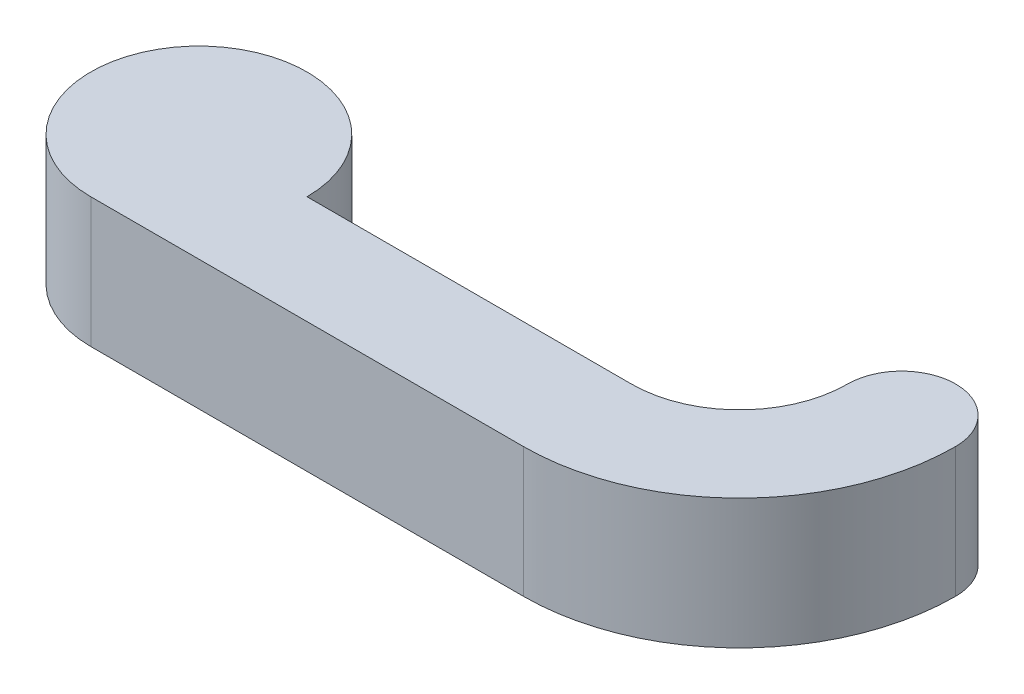
ISO-10303-21;
HEADER;
FILE_DESCRIPTION(('STEP AP214'),'2;1');
FILE_NAME('part.step','',(''),(''),'','','');
FILE_SCHEMA(('AUTOMOTIVE_DESIGN { 1 0 10303 214 1 1 1 1 }'));
ENDSEC;
DATA;
#1=APPLICATION_CONTEXT('core data for automotive mechanical design processes');
#2=APPLICATION_PROTOCOL_DEFINITION('international standard','automotive_design',2000,#1);
#3=PRODUCT_CONTEXT('',#1,'mechanical');
#4=PRODUCT('Part','Part','',(#3));
#5=PRODUCT_RELATED_PRODUCT_CATEGORY('part','',(#4));
#6=PRODUCT_DEFINITION_FORMATION('','',#4);
#7=PRODUCT_DEFINITION_CONTEXT('part definition',#1,'design');
#8=PRODUCT_DEFINITION('design','',#6,#7);
#9=PRODUCT_DEFINITION_SHAPE('','',#8);
#10=(LENGTH_UNIT() NAMED_UNIT(*) SI_UNIT(.MILLI.,.METRE.));
#11=(NAMED_UNIT(*) PLANE_ANGLE_UNIT() SI_UNIT($,.RADIAN.));
#12=(NAMED_UNIT(*) SI_UNIT($,.STERADIAN.) SOLID_ANGLE_UNIT());
#13=UNCERTAINTY_MEASURE_WITH_UNIT(LENGTH_MEASURE(1.E-05),#10,'distance_accuracy_value','');
#14=(GEOMETRIC_REPRESENTATION_CONTEXT(3) GLOBAL_UNCERTAINTY_ASSIGNED_CONTEXT((#13)) GLOBAL_UNIT_ASSIGNED_CONTEXT((#10,
#11,#12)) REPRESENTATION_CONTEXT('',''));
#15=CARTESIAN_POINT('',(0.,0.,0.));
#16=DIRECTION('',(0.,0.,1.));
#17=DIRECTION('',(1.,0.,0.));
#18=AXIS2_PLACEMENT_3D('',#15,#16,#17);
#19=CARTESIAN_POINT('',(0.,3.,0.));
#20=DIRECTION('',(0.,-1.,0.));
#21=DIRECTION('',(0.,0.,-1.));
#22=AXIS2_PLACEMENT_3D('',#19,#20,#21);
#23=CYLINDRICAL_SURFACE('',#22,5.);
#24=CARTESIAN_POINT('',(0.,-3.,0.));
#25=DIRECTION('',(0.,1.,0.));
#26=DIRECTION('',(0.,0.,1.));
#27=AXIS2_PLACEMENT_3D('',#24,#25,#26);
#28=CIRCLE('',#27,5.);
#29=CARTESIAN_POINT('',(5.,-3.,0.));
#30=VERTEX_POINT('',#29);
#31=CARTESIAN_POINT('',(0.,-3.,5.));
#32=VERTEX_POINT('',#31);
#33=EDGE_CURVE('E119',#30,#32,#28,.T.);
#34=ORIENTED_EDGE('',*,*,#33,.T.);
#35=DIRECTION('',(0.,-1.,0.));
#36=VECTOR('',#35,1.);
#37=CARTESIAN_POINT('',(0.,3.,5.));
#38=LINE('',#37,#36);
#39=CARTESIAN_POINT('',(0.,3.,5.));
#40=VERTEX_POINT('',#39);
#41=EDGE_CURVE('E11',#40,#32,#38,.T.);
#42=ORIENTED_EDGE('',*,*,#41,.F.);
#43=CARTESIAN_POINT('',(0.,3.,0.));
#44=DIRECTION('',(0.,1.,0.));
#45=DIRECTION('',(0.,0.,1.));
#46=AXIS2_PLACEMENT_3D('',#43,#44,#45);
#47=CIRCLE('',#46,5.);
#48=CARTESIAN_POINT('',(5.,3.,0.));
#49=VERTEX_POINT('',#48);
#50=EDGE_CURVE('E133',#49,#40,#47,.T.);
#51=ORIENTED_EDGE('',*,*,#50,.F.);
#52=DIRECTION('',(0.,-1.,0.));
#53=VECTOR('',#52,1.);
#54=CARTESIAN_POINT('',(5.,3.,0.));
#55=LINE('',#54,#53);
#56=EDGE_CURVE('E51',#49,#30,#55,.T.);
#57=ORIENTED_EDGE('',*,*,#56,.T.);
#58=EDGE_LOOP('',(#34,#42,#51,#57));
#59=FACE_BOUND('',#58,.T.);
#60=ADVANCED_FACE('F35',(#59),#23,.T.);
#61=CARTESIAN_POINT('',(0.,3.,5.));
#62=DIRECTION('',(0.,0.,-1.));
#63=DIRECTION('',(-1.,0.,0.));
#64=AXIS2_PLACEMENT_3D('',#61,#62,#63);
#65=PLANE('',#64);
#66=DIRECTION('',(1.,0.,0.));
#67=VECTOR('',#66,1.);
#68=CARTESIAN_POINT('',(0.,-3.,5.));
#69=LINE('',#68,#67);
#70=CARTESIAN_POINT('',(20.,-3.,5.));
#71=VERTEX_POINT('',#70);
#72=EDGE_CURVE('E121',#32,#71,#69,.T.);
#73=ORIENTED_EDGE('',*,*,#72,.T.);
#74=DIRECTION('',(0.,-1.,0.));
#75=VECTOR('',#74,1.);
#76=CARTESIAN_POINT('',(20.,3.,5.));
#77=LINE('',#76,#75);
#78=CARTESIAN_POINT('',(20.,3.,5.));
#79=VERTEX_POINT('',#78);
#80=EDGE_CURVE('E43',#79,#71,#77,.T.);
#81=ORIENTED_EDGE('',*,*,#80,.F.);
#82=DIRECTION('',(1.,0.,0.));
#83=VECTOR('',#82,1.);
#84=CARTESIAN_POINT('',(0.,3.,5.));
#85=LINE('',#84,#83);
#86=EDGE_CURVE('E83',#40,#79,#85,.T.);
#87=ORIENTED_EDGE('',*,*,#86,.F.);
#88=ORIENTED_EDGE('',*,*,#41,.T.);
#89=EDGE_LOOP('',(#73,#81,#87,#88));
#90=FACE_BOUND('',#89,.T.);
#91=ADVANCED_FACE('F153',(#90),#65,.F.);
#92=CARTESIAN_POINT('',(20.,3.,-5.));
#93=DIRECTION('',(0.,-1.,0.));
#94=DIRECTION('',(0.,0.,-1.));
#95=AXIS2_PLACEMENT_3D('',#92,#93,#94);
#96=CYLINDRICAL_SURFACE('',#95,10.);
#97=CARTESIAN_POINT('',(20.,-3.,-5.));
#98=DIRECTION('',(0.,1.,0.));
#99=DIRECTION('',(0.,0.,1.));
#100=AXIS2_PLACEMENT_3D('',#97,#98,#99);
#101=CIRCLE('',#100,10.);
#102=CARTESIAN_POINT('',(30.,-3.,-5.));
#103=VERTEX_POINT('',#102);
#104=EDGE_CURVE('E124',#71,#103,#101,.T.);
#105=ORIENTED_EDGE('',*,*,#104,.T.);
#106=DIRECTION('',(0.,-1.,0.));
#107=VECTOR('',#106,1.);
#108=CARTESIAN_POINT('',(30.,3.,-5.));
#109=LINE('',#108,#107);
#110=CARTESIAN_POINT('',(30.,3.,-5.));
#111=VERTEX_POINT('',#110);
#112=EDGE_CURVE('E102',#111,#103,#109,.T.);
#113=ORIENTED_EDGE('',*,*,#112,.F.);
#114=CARTESIAN_POINT('',(20.,3.,-5.));
#115=DIRECTION('',(0.,1.,0.));
#116=DIRECTION('',(0.,0.,1.));
#117=AXIS2_PLACEMENT_3D('',#114,#115,#116);
#118=CIRCLE('',#117,10.);
#119=EDGE_CURVE('E110',#79,#111,#118,.T.);
#120=ORIENTED_EDGE('',*,*,#119,.F.);
#121=ORIENTED_EDGE('',*,*,#80,.T.);
#122=EDGE_LOOP('',(#105,#113,#120,#121));
#123=FACE_BOUND('',#122,.T.);
#124=ADVANCED_FACE('F139',(#123),#96,.T.);
#125=CARTESIAN_POINT('',(27.5,3.,-5.));
#126=DIRECTION('',(0.,-1.,0.));
#127=DIRECTION('',(0.,0.,-1.));
#128=AXIS2_PLACEMENT_3D('',#125,#126,#127);
#129=CYLINDRICAL_SURFACE('',#128,2.5);
#130=CARTESIAN_POINT('',(27.5,-3.,-5.));
#131=DIRECTION('',(0.,1.,0.));
#132=DIRECTION('',(0.,0.,1.));
#133=AXIS2_PLACEMENT_3D('',#130,#131,#132);
#134=CIRCLE('',#133,2.5);
#135=CARTESIAN_POINT('',(25.,-3.,-5.));
#136=VERTEX_POINT('',#135);
#137=EDGE_CURVE('E98',#136,#103,#134,.F.);
#138=ORIENTED_EDGE('',*,*,#137,.F.);
#139=DIRECTION('',(0.,-1.,0.));
#140=VECTOR('',#139,1.);
#141=CARTESIAN_POINT('',(25.,3.,-5.));
#142=LINE('',#141,#140);
#143=CARTESIAN_POINT('',(25.,3.,-5.));
#144=VERTEX_POINT('',#143);
#145=EDGE_CURVE('E93',#144,#136,#142,.T.);
#146=ORIENTED_EDGE('',*,*,#145,.F.);
#147=CARTESIAN_POINT('',(27.5,3.,-5.));
#148=DIRECTION('',(0.,1.,0.));
#149=DIRECTION('',(0.,0.,1.));
#150=AXIS2_PLACEMENT_3D('',#147,#148,#149);
#151=CIRCLE('',#150,2.5);
#152=EDGE_CURVE('E96',#144,#111,#151,.F.);
#153=ORIENTED_EDGE('',*,*,#152,.T.);
#154=ORIENTED_EDGE('',*,*,#112,.T.);
#155=EDGE_LOOP('',(#138,#146,#153,#154));
#156=FACE_BOUND('',#155,.T.);
#157=ADVANCED_FACE('F95',(#156),#129,.T.);
#158=CARTESIAN_POINT('',(20.,3.,-5.));
#159=DIRECTION('',(0.,-1.,0.));
#160=DIRECTION('',(0.,0.,-1.));
#161=AXIS2_PLACEMENT_3D('',#158,#159,#160);
#162=CYLINDRICAL_SURFACE('',#161,5.);
#163=CARTESIAN_POINT('',(20.,-3.,-5.));
#164=DIRECTION('',(0.,1.,0.));
#165=DIRECTION('',(0.,0.,1.));
#166=AXIS2_PLACEMENT_3D('',#163,#164,#165);
#167=CIRCLE('',#166,5.);
#168=CARTESIAN_POINT('',(20.,-3.,0.));
#169=VERTEX_POINT('',#168);
#170=EDGE_CURVE('E128',#169,#136,#167,.T.);
#171=ORIENTED_EDGE('',*,*,#170,.F.);
#172=DIRECTION('',(0.,-1.,0.));
#173=VECTOR('',#172,1.);
#174=CARTESIAN_POINT('',(20.,3.,0.));
#175=LINE('',#174,#173);
#176=CARTESIAN_POINT('',(20.,3.,0.));
#177=VERTEX_POINT('',#176);
#178=EDGE_CURVE('E71',#177,#169,#175,.T.);
#179=ORIENTED_EDGE('',*,*,#178,.F.);
#180=CARTESIAN_POINT('',(20.,3.,-5.));
#181=DIRECTION('',(0.,1.,0.));
#182=DIRECTION('',(0.,0.,1.));
#183=AXIS2_PLACEMENT_3D('',#180,#181,#182);
#184=CIRCLE('',#183,5.);
#185=EDGE_CURVE('E108',#177,#144,#184,.T.);
#186=ORIENTED_EDGE('',*,*,#185,.T.);
#187=ORIENTED_EDGE('',*,*,#145,.T.);
#188=EDGE_LOOP('',(#171,#179,#186,#187));
#189=FACE_BOUND('',#188,.T.);
#190=ADVANCED_FACE('F113',(#189),#162,.F.);
#191=CARTESIAN_POINT('',(0.,3.,0.));
#192=DIRECTION('',(0.,0.,-1.));
#193=DIRECTION('',(-1.,0.,0.));
#194=AXIS2_PLACEMENT_3D('',#191,#192,#193);
#195=PLANE('',#194);
#196=DIRECTION('',(1.,0.,0.));
#197=VECTOR('',#196,1.);
#198=CARTESIAN_POINT('',(0.,-3.,0.));
#199=LINE('',#198,#197);
#200=EDGE_CURVE('E130',#30,#169,#199,.T.);
#201=ORIENTED_EDGE('',*,*,#200,.F.);
#202=ORIENTED_EDGE('',*,*,#56,.F.);
#203=DIRECTION('',(1.,0.,0.));
#204=VECTOR('',#203,1.);
#205=CARTESIAN_POINT('',(0.,3.,0.));
#206=LINE('',#205,#204);
#207=EDGE_CURVE('E114',#49,#177,#206,.T.);
#208=ORIENTED_EDGE('',*,*,#207,.T.);
#209=ORIENTED_EDGE('',*,*,#178,.T.);
#210=EDGE_LOOP('',(#201,#202,#208,#209));
#211=FACE_BOUND('',#210,.T.);
#212=ADVANCED_FACE('F142',(#211),#195,.T.);
#213=CARTESIAN_POINT('',(0.,3.,0.));
#214=DIRECTION('',(0.,1.,0.));
#215=DIRECTION('',(0.,0.,1.));
#216=AXIS2_PLACEMENT_3D('',#213,#214,#215);
#217=PLANE('',#216);
#218=ORIENTED_EDGE('',*,*,#50,.T.);
#219=ORIENTED_EDGE('',*,*,#86,.T.);
#220=ORIENTED_EDGE('',*,*,#119,.T.);
#221=ORIENTED_EDGE('',*,*,#152,.F.);
#222=ORIENTED_EDGE('',*,*,#185,.F.);
#223=ORIENTED_EDGE('',*,*,#207,.F.);
#224=EDGE_LOOP('',(#218,#219,#220,#221,#222,#223));
#225=FACE_BOUND('',#224,.T.);
#226=ADVANCED_FACE('F106',(#225),#217,.T.);
#227=CARTESIAN_POINT('',(0.,-3.,0.));
#228=DIRECTION('',(0.,1.,0.));
#229=DIRECTION('',(0.,0.,1.));
#230=AXIS2_PLACEMENT_3D('',#227,#228,#229);
#231=PLANE('',#230);
#232=CARTESIAN_POINT('',(0.,-3.,0.));
#233=DIRECTION('',(0.,-1.,0.));
#234=DIRECTION('',(0.,0.,-1.));
#235=AXIS2_PLACEMENT_3D('',#232,#233,#234);
#236=CIRCLE('',#235,3.);
#237=CARTESIAN_POINT('',(0.,-3.,-3.));
#238=VERTEX_POINT('',#237);
#239=EDGE_CURVE('E161',#238,#238,#236,.T.);
#240=ORIENTED_EDGE('',*,*,#239,.F.);
#241=EDGE_LOOP('',(#240));
#242=FACE_BOUND('',#241,.T.);
#243=ORIENTED_EDGE('',*,*,#33,.F.);
#244=ORIENTED_EDGE('',*,*,#200,.T.);
#245=ORIENTED_EDGE('',*,*,#170,.T.);
#246=ORIENTED_EDGE('',*,*,#137,.T.);
#247=ORIENTED_EDGE('',*,*,#104,.F.);
#248=ORIENTED_EDGE('',*,*,#72,.F.);
#249=EDGE_LOOP('',(#243,#244,#245,#246,#247,#248));
#250=FACE_BOUND('',#249,.T.);
#251=ADVANCED_FACE('F141',(#242,#250),#231,.F.);
#252=CARTESIAN_POINT('',(0.,-0.5,0.));
#253=DIRECTION('',(0.,-1.,0.));
#254=DIRECTION('',(0.,0.,-1.));
#255=AXIS2_PLACEMENT_3D('',#252,#253,#254);
#256=CYLINDRICAL_SURFACE('',#255,3.);
#257=CARTESIAN_POINT('',(0.,-0.5,0.));
#258=DIRECTION('',(0.,-1.,0.));
#259=DIRECTION('',(0.,0.,-1.));
#260=AXIS2_PLACEMENT_3D('',#257,#258,#259);
#261=CIRCLE('',#260,3.);
#262=CARTESIAN_POINT('',(0.,-0.5,-3.));
#263=VERTEX_POINT('',#262);
#264=EDGE_CURVE('E122',#263,#263,#261,.T.);
#265=ORIENTED_EDGE('',*,*,#264,.F.);
#266=EDGE_LOOP('',(#265));
#267=FACE_BOUND('',#266,.T.);
#268=ORIENTED_EDGE('',*,*,#239,.T.);
#269=EDGE_LOOP('',(#268));
#270=FACE_BOUND('',#269,.T.);
#271=ADVANCED_FACE('F169',(#267,#270),#256,.F.);
#272=CARTESIAN_POINT('',(0.,-0.5,0.));
#273=DIRECTION('',(0.,-1.,0.));
#274=DIRECTION('',(0.,0.,-1.));
#275=AXIS2_PLACEMENT_3D('',#272,#273,#274);
#276=PLANE('',#275);
#277=ORIENTED_EDGE('',*,*,#264,.T.);
#278=EDGE_LOOP('',(#277));
#279=FACE_BOUND('',#278,.T.);
#280=ADVANCED_FACE('F167',(#279),#276,.T.);
#281=CLOSED_SHELL('',(#60,#91,#124,#157,#190,#212,#226,#251,#271,#280));
#282=MANIFOLD_SOLID_BREP('B2',#281);
#283=ADVANCED_BREP_SHAPE_REPRESENTATION('',(#18,#282),#14);
#284=SHAPE_DEFINITION_REPRESENTATION(#9,#283);
ENDSEC;
END-ISO-10303-21;
